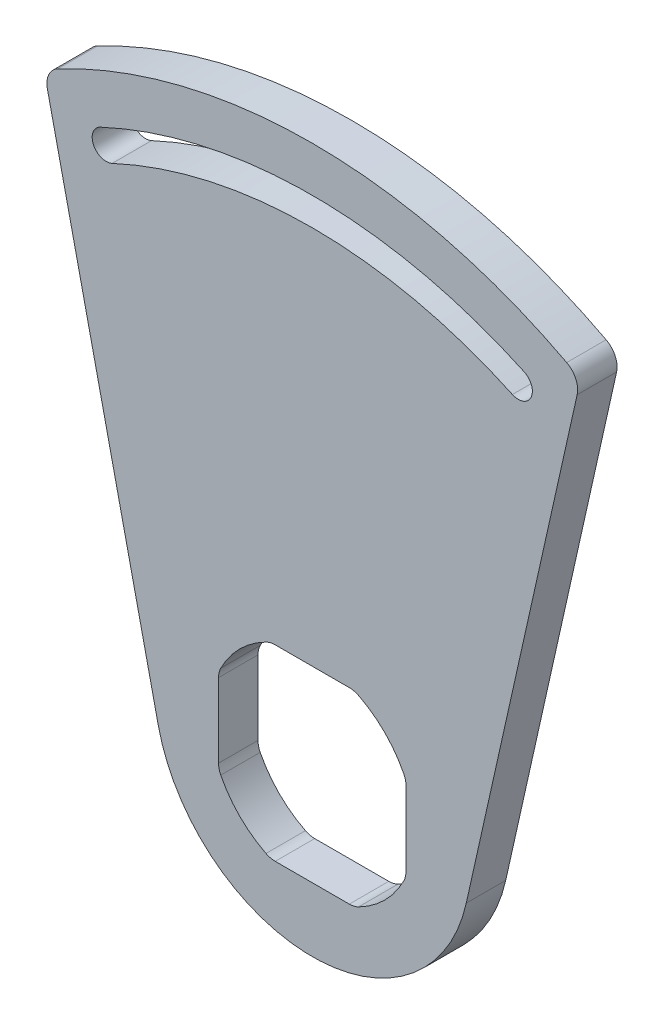
ISO-10303-21;
HEADER;
FILE_DESCRIPTION(('STEP AP214'),'2;1');
FILE_NAME('part.step','',(''),(''),'','','');
FILE_SCHEMA(('AUTOMOTIVE_DESIGN { 1 0 10303 214 1 1 1 1 }'));
ENDSEC;
DATA;
#1=APPLICATION_CONTEXT('core data for automotive mechanical design processes');
#2=APPLICATION_PROTOCOL_DEFINITION('international standard','automotive_design',2000,#1);
#3=PRODUCT_CONTEXT('',#1,'mechanical');
#4=PRODUCT('Part','Part','',(#3));
#5=PRODUCT_RELATED_PRODUCT_CATEGORY('part','',(#4));
#6=PRODUCT_DEFINITION_FORMATION('','',#4);
#7=PRODUCT_DEFINITION_CONTEXT('part definition',#1,'design');
#8=PRODUCT_DEFINITION('design','',#6,#7);
#9=PRODUCT_DEFINITION_SHAPE('','',#8);
#10=(LENGTH_UNIT() NAMED_UNIT(*) SI_UNIT(.MILLI.,.METRE.));
#11=(NAMED_UNIT(*) PLANE_ANGLE_UNIT() SI_UNIT($,.RADIAN.));
#12=(NAMED_UNIT(*) SI_UNIT($,.STERADIAN.) SOLID_ANGLE_UNIT());
#13=UNCERTAINTY_MEASURE_WITH_UNIT(LENGTH_MEASURE(1.E-05),#10,'distance_accuracy_value','');
#14=(GEOMETRIC_REPRESENTATION_CONTEXT(3) GLOBAL_UNCERTAINTY_ASSIGNED_CONTEXT((#13)) GLOBAL_UNIT_ASSIGNED_CONTEXT((#10,
#11,#12)) REPRESENTATION_CONTEXT('',''));
#15=CARTESIAN_POINT('',(0.,0.,0.));
#16=DIRECTION('',(0.,0.,1.));
#17=DIRECTION('',(1.,0.,0.));
#18=AXIS2_PLACEMENT_3D('',#15,#16,#17);
#19=CARTESIAN_POINT('',(0.,0.,6.35));
#20=DIRECTION('',(0.,0.,-1.));
#21=DIRECTION('',(-1.,0.,0.));
#22=AXIS2_PLACEMENT_3D('',#19,#20,#21);
#23=CYLINDRICAL_SURFACE('',#22,88.011);
#24=CARTESIAN_POINT('',(0.,0.,6.35));
#25=DIRECTION('',(0.,0.,1.));
#26=DIRECTION('',(1.,0.,0.));
#27=AXIS2_PLACEMENT_3D('',#24,#25,#26);
#28=CIRCLE('',#27,88.011);
#29=CARTESIAN_POINT('',(-40.9525219897179,77.9026768710914,6.35));
#30=VERTEX_POINT('',#29);
#31=CARTESIAN_POINT('',(40.9525219897176,77.9026768710915,6.35));
#32=VERTEX_POINT('',#31);
#33=EDGE_CURVE('E244',#30,#32,#28,.F.);
#34=ORIENTED_EDGE('',*,*,#33,.T.);
#35=DIRECTION('',(0.,0.,-1.));
#36=VECTOR('',#35,1.);
#37=CARTESIAN_POINT('',(40.9525219897176,77.9026768710915,6.35));
#38=LINE('',#37,#36);
#39=CARTESIAN_POINT('',(40.9525219897176,77.9026768710915,0.));
#40=VERTEX_POINT('',#39);
#41=EDGE_CURVE('E382',#32,#40,#38,.T.);
#42=ORIENTED_EDGE('',*,*,#41,.T.);
#43=CARTESIAN_POINT('',(0.,0.,0.));
#44=DIRECTION('',(0.,0.,1.));
#45=DIRECTION('',(1.,0.,0.));
#46=AXIS2_PLACEMENT_3D('',#43,#44,#45);
#47=CIRCLE('',#46,88.011);
#48=CARTESIAN_POINT('',(-40.9525219897179,77.9026768710914,0.));
#49=VERTEX_POINT('',#48);
#50=EDGE_CURVE('E288',#49,#40,#47,.F.);
#51=ORIENTED_EDGE('',*,*,#50,.F.);
#52=DIRECTION('',(0.,0.,-1.));
#53=VECTOR('',#52,1.);
#54=CARTESIAN_POINT('',(-40.9525219897179,77.9026768710914,6.35));
#55=LINE('',#54,#53);
#56=EDGE_CURVE('E380',#49,#30,#55,.F.);
#57=ORIENTED_EDGE('',*,*,#56,.T.);
#58=EDGE_LOOP('',(#34,#42,#51,#57));
#59=FACE_BOUND('',#58,.T.);
#60=ADVANCED_FACE('F37',(#59),#23,.T.);
#61=CARTESIAN_POINT('',(-24.7874429520375,-5.5446074612623,6.35));
#62=DIRECTION('',(-0.975883580788879,-0.218291632333161,0.));
#63=DIRECTION('',(0.218291632333161,-0.975883580788879,0.));
#64=AXIS2_PLACEMENT_3D('',#61,#62,#63);
#65=PLANE('',#64);
#66=DIRECTION('',(-0.218291632333161,0.975883580788879,0.));
#67=VECTOR('',#66,1.);
#68=CARTESIAN_POINT('',(-24.7874429520375,-5.5446074612623,6.35));
#69=LINE('',#68,#67);
#70=CARTESIAN_POINT('',(-24.7874429520375,-5.5446074612623,6.35));
#71=VERTEX_POINT('',#70);
#72=CARTESIAN_POINT('',(-42.6384313170143,74.2591223475221,6.35));
#73=VERTEX_POINT('',#72);
#74=EDGE_CURVE('E247',#71,#73,#69,.T.);
#75=ORIENTED_EDGE('',*,*,#74,.T.);
#76=DIRECTION('',(0.,0.,-1.));
#77=VECTOR('',#76,1.);
#78=CARTESIAN_POINT('',(-42.6384313170143,74.2591223475221,6.35));
#79=LINE('',#78,#77);
#80=CARTESIAN_POINT('',(-42.6384313170143,74.2591223475221,0.));
#81=VERTEX_POINT('',#80);
#82=EDGE_CURVE('E11',#73,#81,#79,.T.);
#83=ORIENTED_EDGE('',*,*,#82,.T.);
#84=DIRECTION('',(-0.218291632333161,0.975883580788879,0.));
#85=VECTOR('',#84,1.);
#86=CARTESIAN_POINT('',(-24.7874429520375,-5.5446074612623,0.));
#87=LINE('',#86,#85);
#88=CARTESIAN_POINT('',(-24.7874429520375,-5.5446074612623,0.));
#89=VERTEX_POINT('',#88);
#90=EDGE_CURVE('E291',#89,#81,#87,.T.);
#91=ORIENTED_EDGE('',*,*,#90,.F.);
#92=DIRECTION('',(0.,0.,-1.));
#93=VECTOR('',#92,1.);
#94=CARTESIAN_POINT('',(-24.7874429520375,-5.5446074612623,6.35));
#95=LINE('',#94,#93);
#96=EDGE_CURVE('E302',#71,#89,#95,.T.);
#97=ORIENTED_EDGE('',*,*,#96,.F.);
#98=EDGE_LOOP('',(#75,#83,#91,#97));
#99=FACE_BOUND('',#98,.T.);
#100=ADVANCED_FACE('F407',(#99),#65,.T.);
#101=CARTESIAN_POINT('',(0.,0.,6.35));
#102=DIRECTION('',(0.,0.,-1.));
#103=DIRECTION('',(-1.,0.,0.));
#104=AXIS2_PLACEMENT_3D('',#101,#102,#103);
#105=CYLINDRICAL_SURFACE('',#104,25.4);
#106=CARTESIAN_POINT('',(0.,0.,0.));
#107=DIRECTION('',(0.,0.,1.));
#108=DIRECTION('',(1.,0.,0.));
#109=AXIS2_PLACEMENT_3D('',#106,#107,#108);
#110=CIRCLE('',#109,25.4);
#111=CARTESIAN_POINT('',(24.7874429520375,-5.5446074612622,0.));
#112=VERTEX_POINT('',#111);
#113=EDGE_CURVE('E294',#89,#112,#110,.T.);
#114=ORIENTED_EDGE('',*,*,#113,.T.);
#115=DIRECTION('',(0.,0.,-1.));
#116=VECTOR('',#115,1.);
#117=CARTESIAN_POINT('',(24.7874429520375,-5.5446074612622,6.35));
#118=LINE('',#117,#116);
#119=CARTESIAN_POINT('',(24.7874429520375,-5.5446074612622,6.35));
#120=VERTEX_POINT('',#119);
#121=EDGE_CURVE('E223',#120,#112,#118,.T.);
#122=ORIENTED_EDGE('',*,*,#121,.F.);
#123=CARTESIAN_POINT('',(0.,0.,6.35));
#124=DIRECTION('',(0.,0.,1.));
#125=DIRECTION('',(1.,0.,0.));
#126=AXIS2_PLACEMENT_3D('',#123,#124,#125);
#127=CIRCLE('',#126,25.4);
#128=EDGE_CURVE('E249',#71,#120,#127,.T.);
#129=ORIENTED_EDGE('',*,*,#128,.F.);
#130=ORIENTED_EDGE('',*,*,#96,.T.);
#131=EDGE_LOOP('',(#114,#122,#129,#130));
#132=FACE_BOUND('',#131,.T.);
#133=ADVANCED_FACE('F404',(#132),#105,.T.);
#134=CARTESIAN_POINT('',(-33.1696168909806,71.1324729733585,6.35));
#135=DIRECTION('',(0.,0.,-1.));
#136=DIRECTION('',(-1.,0.,0.));
#137=AXIS2_PLACEMENT_3D('',#134,#135,#136);
#138=CYLINDRICAL_SURFACE('',#137,2.2606000000003);
#139=CARTESIAN_POINT('',(-33.1696168909806,71.1324729733585,0.));
#140=DIRECTION('',(0.,0.,1.));
#141=DIRECTION('',(1.,0.,0.));
#142=AXIS2_PLACEMENT_3D('',#139,#140,#141);
#143=CIRCLE('',#142,2.2606000000003);
#144=CARTESIAN_POINT('',(-34.1249888205343,73.1812718498279,0.));
#145=VERTEX_POINT('',#144);
#146=CARTESIAN_POINT('',(-32.2142470766446,69.0836731105469,0.));
#147=VERTEX_POINT('',#146);
#148=EDGE_CURVE('E218',#145,#147,#143,.T.);
#149=ORIENTED_EDGE('',*,*,#148,.F.);
#150=DIRECTION('',(0.,0.,-1.));
#151=VECTOR('',#150,1.);
#152=CARTESIAN_POINT('',(-34.1249888205343,73.1812718498279,6.35));
#153=LINE('',#152,#151);
#154=CARTESIAN_POINT('',(-34.1249888205343,73.1812718498279,6.35));
#155=VERTEX_POINT('',#154);
#156=EDGE_CURVE('E213',#155,#145,#153,.T.);
#157=ORIENTED_EDGE('',*,*,#156,.F.);
#158=CARTESIAN_POINT('',(-33.1696168909806,71.1324729733585,6.35));
#159=DIRECTION('',(0.,0.,1.));
#160=DIRECTION('',(1.,0.,0.));
#161=AXIS2_PLACEMENT_3D('',#158,#159,#160);
#162=CIRCLE('',#161,2.2606000000003);
#163=CARTESIAN_POINT('',(-32.2142470766446,69.0836731105469,6.35));
#164=VERTEX_POINT('',#163);
#165=EDGE_CURVE('E216',#155,#164,#162,.T.);
#166=ORIENTED_EDGE('',*,*,#165,.T.);
#167=DIRECTION('',(0.,0.,-1.));
#168=VECTOR('',#167,1.);
#169=CARTESIAN_POINT('',(-32.2142470766446,69.0836731105469,6.35));
#170=LINE('',#169,#168);
#171=EDGE_CURVE('E254',#164,#147,#170,.T.);
#172=ORIENTED_EDGE('',*,*,#171,.T.);
#173=EDGE_LOOP('',(#149,#157,#166,#172));
#174=FACE_BOUND('',#173,.T.);
#175=ADVANCED_FACE('F215',(#174),#138,.F.);
#176=CARTESIAN_POINT('',(0.,0.,6.35));
#177=DIRECTION('',(0.,0.,-1.));
#178=DIRECTION('',(-1.,0.,0.));
#179=AXIS2_PLACEMENT_3D('',#176,#177,#178);
#180=CYLINDRICAL_SURFACE('',#179,80.7466);
#181=CARTESIAN_POINT('',(0.,0.,0.));
#182=DIRECTION('',(0.,0.,1.));
#183=DIRECTION('',(1.,0.,0.));
#184=AXIS2_PLACEMENT_3D('',#181,#182,#183);
#185=CIRCLE('',#184,80.7466);
#186=CARTESIAN_POINT('',(34.1249888205343,73.1812718498279,0.));
#187=VERTEX_POINT('',#186);
#188=EDGE_CURVE('E280',#187,#145,#185,.T.);
#189=ORIENTED_EDGE('',*,*,#188,.F.);
#190=DIRECTION('',(0.,0.,-1.));
#191=VECTOR('',#190,1.);
#192=CARTESIAN_POINT('',(34.1249888205343,73.1812718498279,6.35));
#193=LINE('',#192,#191);
#194=CARTESIAN_POINT('',(34.1249888205343,73.1812718498279,6.35));
#195=VERTEX_POINT('',#194);
#196=EDGE_CURVE('E224',#195,#187,#193,.T.);
#197=ORIENTED_EDGE('',*,*,#196,.F.);
#198=CARTESIAN_POINT('',(0.,0.,6.35));
#199=DIRECTION('',(0.,0.,1.));
#200=DIRECTION('',(1.,0.,0.));
#201=AXIS2_PLACEMENT_3D('',#198,#199,#200);
#202=CIRCLE('',#201,80.7466);
#203=EDGE_CURVE('E230',#195,#155,#202,.T.);
#204=ORIENTED_EDGE('',*,*,#203,.T.);
#205=ORIENTED_EDGE('',*,*,#156,.T.);
#206=EDGE_LOOP('',(#189,#197,#204,#205));
#207=FACE_BOUND('',#206,.T.);
#208=ADVANCED_FACE('F237',(#207),#180,.F.);
#209=CARTESIAN_POINT('',(33.1696168909806,71.1324729733585,6.35));
#210=DIRECTION('',(0.,0.,-1.));
#211=DIRECTION('',(-1.,0.,0.));
#212=AXIS2_PLACEMENT_3D('',#209,#210,#211);
#213=CYLINDRICAL_SURFACE('',#212,2.26060000000027);
#214=CARTESIAN_POINT('',(33.1696168909806,71.1324729733585,0.));
#215=DIRECTION('',(0.,0.,1.));
#216=DIRECTION('',(1.,0.,0.));
#217=AXIS2_PLACEMENT_3D('',#214,#215,#216);
#218=CIRCLE('',#217,2.26060000000027);
#219=CARTESIAN_POINT('',(32.2142470766445,69.0836731105469,0.));
#220=VERTEX_POINT('',#219);
#221=EDGE_CURVE('E282',#220,#187,#218,.T.);
#222=ORIENTED_EDGE('',*,*,#221,.F.);
#223=DIRECTION('',(0.,0.,-1.));
#224=VECTOR('',#223,1.);
#225=CARTESIAN_POINT('',(32.2142470766445,69.0836731105469,6.35));
#226=LINE('',#225,#224);
#227=CARTESIAN_POINT('',(32.2142470766445,69.0836731105469,6.35));
#228=VERTEX_POINT('',#227);
#229=EDGE_CURVE('E306',#228,#220,#226,.T.);
#230=ORIENTED_EDGE('',*,*,#229,.F.);
#231=CARTESIAN_POINT('',(33.1696168909806,71.1324729733585,6.35));
#232=DIRECTION('',(0.,0.,1.));
#233=DIRECTION('',(1.,0.,0.));
#234=AXIS2_PLACEMENT_3D('',#231,#232,#233);
#235=CIRCLE('',#234,2.26060000000027);
#236=EDGE_CURVE('E238',#228,#195,#235,.T.);
#237=ORIENTED_EDGE('',*,*,#236,.T.);
#238=ORIENTED_EDGE('',*,*,#196,.T.);
#239=EDGE_LOOP('',(#222,#230,#237,#238));
#240=FACE_BOUND('',#239,.T.);
#241=ADVANCED_FACE('F430',(#240),#213,.F.);
#242=CARTESIAN_POINT('',(0.,0.,6.35));
#243=DIRECTION('',(0.,0.,-1.));
#244=DIRECTION('',(-1.,0.,0.));
#245=AXIS2_PLACEMENT_3D('',#242,#243,#244);
#246=CYLINDRICAL_SURFACE('',#245,16.51);
#247=CARTESIAN_POINT('',(0.,0.,0.));
#248=DIRECTION('',(0.,0.,1.));
#249=DIRECTION('',(1.,0.,0.));
#250=AXIS2_PLACEMENT_3D('',#247,#248,#249);
#251=CIRCLE('',#250,16.51);
#252=CARTESIAN_POINT('',(-7.45307158156958,14.732,0.));
#253=VERTEX_POINT('',#252);
#254=CARTESIAN_POINT('',(-14.732,7.45307158156957,0.));
#255=VERTEX_POINT('',#254);
#256=EDGE_CURVE('E255',#253,#255,#251,.T.);
#257=ORIENTED_EDGE('',*,*,#256,.F.);
#258=DIRECTION('',(0.,0.,-1.));
#259=VECTOR('',#258,1.);
#260=CARTESIAN_POINT('',(-7.45307158156958,14.732,6.35));
#261=LINE('',#260,#259);
#262=CARTESIAN_POINT('',(-7.45307158156958,14.732,6.35));
#263=VERTEX_POINT('',#262);
#264=EDGE_CURVE('E316',#253,#263,#261,.F.);
#265=ORIENTED_EDGE('',*,*,#264,.T.);
#266=CARTESIAN_POINT('',(0.,0.,6.35));
#267=DIRECTION('',(0.,0.,1.));
#268=DIRECTION('',(1.,0.,0.));
#269=AXIS2_PLACEMENT_3D('',#266,#267,#268);
#270=CIRCLE('',#269,16.51);
#271=CARTESIAN_POINT('',(-14.732,7.45307158156957,6.35));
#272=VERTEX_POINT('',#271);
#273=EDGE_CURVE('E299',#263,#272,#270,.T.);
#274=ORIENTED_EDGE('',*,*,#273,.T.);
#275=DIRECTION('',(0.,0.,-1.));
#276=VECTOR('',#275,1.);
#277=CARTESIAN_POINT('',(-14.732,7.45307158156957,6.35));
#278=LINE('',#277,#276);
#279=EDGE_CURVE('E313',#272,#255,#278,.T.);
#280=ORIENTED_EDGE('',*,*,#279,.T.);
#281=EDGE_LOOP('',(#257,#265,#274,#280));
#282=FACE_BOUND('',#281,.T.);
#283=ADVANCED_FACE('F433',(#282),#246,.F.);
#284=CARTESIAN_POINT('',(0.,15.0876,6.35));
#285=DIRECTION('',(0.,-1.,0.));
#286=DIRECTION('',(1.,0.,0.));
#287=AXIS2_PLACEMENT_3D('',#284,#285,#286);
#288=PLANE('',#287);
#289=DIRECTION('',(-1.,0.,0.));
#290=VECTOR('',#289,1.);
#291=CARTESIAN_POINT('',(0.,15.0876,6.35));
#292=LINE('',#291,#290);
#293=CARTESIAN_POINT('',(5.96245726525566,15.0876,6.35));
#294=VERTEX_POINT('',#293);
#295=CARTESIAN_POINT('',(-5.96245726525566,15.0876,6.35));
#296=VERTEX_POINT('',#295);
#297=EDGE_CURVE('E510',#294,#296,#292,.T.);
#298=ORIENTED_EDGE('',*,*,#297,.T.);
#299=DIRECTION('',(0.,0.,1.));
#300=VECTOR('',#299,1.);
#301=CARTESIAN_POINT('',(-5.96245726525566,15.0876,0.));
#302=LINE('',#301,#300);
#303=CARTESIAN_POINT('',(-5.96245726525566,15.0876,0.));
#304=VERTEX_POINT('',#303);
#305=EDGE_CURVE('E310',#296,#304,#302,.F.);
#306=ORIENTED_EDGE('',*,*,#305,.T.);
#307=DIRECTION('',(-1.,0.,0.));
#308=VECTOR('',#307,1.);
#309=CARTESIAN_POINT('',(0.,15.0876,0.));
#310=LINE('',#309,#308);
#311=CARTESIAN_POINT('',(5.96245726525566,15.0876,0.));
#312=VERTEX_POINT('',#311);
#313=EDGE_CURVE('E258',#312,#304,#310,.T.);
#314=ORIENTED_EDGE('',*,*,#313,.F.);
#315=DIRECTION('',(0.,0.,1.));
#316=VECTOR('',#315,1.);
#317=CARTESIAN_POINT('',(5.96245726525566,15.0876,6.35));
#318=LINE('',#317,#316);
#319=EDGE_CURVE('E304',#312,#294,#318,.T.);
#320=ORIENTED_EDGE('',*,*,#319,.T.);
#321=EDGE_LOOP('',(#298,#306,#314,#320));
#322=FACE_BOUND('',#321,.T.);
#323=ADVANCED_FACE('F460',(#322),#288,.T.);
#324=CARTESIAN_POINT('',(0.,0.,6.35));
#325=DIRECTION('',(0.,0.,-1.));
#326=DIRECTION('',(-1.,0.,0.));
#327=AXIS2_PLACEMENT_3D('',#324,#325,#326);
#328=CYLINDRICAL_SURFACE('',#327,16.51);
#329=CARTESIAN_POINT('',(0.,0.,6.35));
#330=DIRECTION('',(0.,0.,1.));
#331=DIRECTION('',(1.,0.,0.));
#332=AXIS2_PLACEMENT_3D('',#329,#330,#331);
#333=CIRCLE('',#332,16.51);
#334=CARTESIAN_POINT('',(14.732,7.45307158156958,6.35));
#335=VERTEX_POINT('',#334);
#336=CARTESIAN_POINT('',(7.45307158156958,14.732,6.35));
#337=VERTEX_POINT('',#336);
#338=EDGE_CURVE('E513',#335,#337,#333,.T.);
#339=ORIENTED_EDGE('',*,*,#338,.T.);
#340=DIRECTION('',(0.,0.,-1.));
#341=VECTOR('',#340,1.);
#342=CARTESIAN_POINT('',(7.45307158156958,14.732,6.35));
#343=LINE('',#342,#341);
#344=CARTESIAN_POINT('',(7.45307158156958,14.732,0.));
#345=VERTEX_POINT('',#344);
#346=EDGE_CURVE('E320',#337,#345,#343,.T.);
#347=ORIENTED_EDGE('',*,*,#346,.T.);
#348=CARTESIAN_POINT('',(0.,0.,0.));
#349=DIRECTION('',(0.,0.,1.));
#350=DIRECTION('',(1.,0.,0.));
#351=AXIS2_PLACEMENT_3D('',#348,#349,#350);
#352=CIRCLE('',#351,16.51);
#353=CARTESIAN_POINT('',(14.732,7.45307158156958,0.));
#354=VERTEX_POINT('',#353);
#355=EDGE_CURVE('E261',#354,#345,#352,.T.);
#356=ORIENTED_EDGE('',*,*,#355,.F.);
#357=DIRECTION('',(0.,0.,-1.));
#358=VECTOR('',#357,1.);
#359=CARTESIAN_POINT('',(14.732,7.45307158156958,6.35));
#360=LINE('',#359,#358);
#361=EDGE_CURVE('E318',#354,#335,#360,.F.);
#362=ORIENTED_EDGE('',*,*,#361,.T.);
#363=EDGE_LOOP('',(#339,#347,#356,#362));
#364=FACE_BOUND('',#363,.T.);
#365=ADVANCED_FACE('F456',(#364),#328,.F.);
#366=CARTESIAN_POINT('',(15.0876,0.,6.35));
#367=DIRECTION('',(-1.,0.,0.));
#368=DIRECTION('',(0.,0.,1.));
#369=AXIS2_PLACEMENT_3D('',#366,#367,#368);
#370=PLANE('',#369);
#371=DIRECTION('',(0.,1.,0.));
#372=VECTOR('',#371,1.);
#373=CARTESIAN_POINT('',(15.0876,0.,0.));
#374=LINE('',#373,#372);
#375=CARTESIAN_POINT('',(15.0876,-5.96245726525566,0.));
#376=VERTEX_POINT('',#375);
#377=CARTESIAN_POINT('',(15.0876,5.96245726525566,0.));
#378=VERTEX_POINT('',#377);
#379=EDGE_CURVE('E264',#376,#378,#374,.T.);
#380=ORIENTED_EDGE('',*,*,#379,.F.);
#381=DIRECTION('',(0.,0.,1.));
#382=VECTOR('',#381,1.);
#383=CARTESIAN_POINT('',(15.0876,-5.96245726525566,6.35));
#384=LINE('',#383,#382);
#385=CARTESIAN_POINT('',(15.0876,-5.96245726525566,6.35));
#386=VERTEX_POINT('',#385);
#387=EDGE_CURVE('E331',#376,#386,#384,.T.);
#388=ORIENTED_EDGE('',*,*,#387,.T.);
#389=DIRECTION('',(0.,1.,0.));
#390=VECTOR('',#389,1.);
#391=CARTESIAN_POINT('',(15.0876,0.,6.35));
#392=LINE('',#391,#390);
#393=CARTESIAN_POINT('',(15.0876,5.96245726525566,6.35));
#394=VERTEX_POINT('',#393);
#395=EDGE_CURVE('E518',#386,#394,#392,.T.);
#396=ORIENTED_EDGE('',*,*,#395,.T.);
#397=DIRECTION('',(0.,0.,1.));
#398=VECTOR('',#397,1.);
#399=CARTESIAN_POINT('',(15.0876,5.96245726525566,0.));
#400=LINE('',#399,#398);
#401=EDGE_CURVE('E328',#394,#378,#400,.F.);
#402=ORIENTED_EDGE('',*,*,#401,.T.);
#403=EDGE_LOOP('',(#380,#388,#396,#402));
#404=FACE_BOUND('',#403,.T.);
#405=ADVANCED_FACE('F452',(#404),#370,.T.);
#406=CARTESIAN_POINT('',(0.,0.,6.35));
#407=DIRECTION('',(0.,0.,-1.));
#408=DIRECTION('',(-1.,0.,0.));
#409=AXIS2_PLACEMENT_3D('',#406,#407,#408);
#410=CYLINDRICAL_SURFACE('',#409,16.51);
#411=CARTESIAN_POINT('',(0.,0.,6.35));
#412=DIRECTION('',(0.,0.,1.));
#413=DIRECTION('',(1.,0.,0.));
#414=AXIS2_PLACEMENT_3D('',#411,#412,#413);
#415=CIRCLE('',#414,16.51);
#416=CARTESIAN_POINT('',(7.45307158156958,-14.732,6.35));
#417=VERTEX_POINT('',#416);
#418=CARTESIAN_POINT('',(14.732,-7.45307158156958,6.35));
#419=VERTEX_POINT('',#418);
#420=EDGE_CURVE('E521',#417,#419,#415,.T.);
#421=ORIENTED_EDGE('',*,*,#420,.T.);
#422=DIRECTION('',(0.,0.,-1.));
#423=VECTOR('',#422,1.);
#424=CARTESIAN_POINT('',(14.732,-7.45307158156958,6.35));
#425=LINE('',#424,#423);
#426=CARTESIAN_POINT('',(14.732,-7.45307158156958,0.));
#427=VERTEX_POINT('',#426);
#428=EDGE_CURVE('E325',#419,#427,#425,.T.);
#429=ORIENTED_EDGE('',*,*,#428,.T.);
#430=CARTESIAN_POINT('',(0.,0.,0.));
#431=DIRECTION('',(0.,0.,1.));
#432=DIRECTION('',(1.,0.,0.));
#433=AXIS2_PLACEMENT_3D('',#430,#431,#432);
#434=CIRCLE('',#433,16.51);
#435=CARTESIAN_POINT('',(7.45307158156958,-14.732,0.));
#436=VERTEX_POINT('',#435);
#437=EDGE_CURVE('E267',#436,#427,#434,.T.);
#438=ORIENTED_EDGE('',*,*,#437,.F.);
#439=DIRECTION('',(0.,0.,-1.));
#440=VECTOR('',#439,1.);
#441=CARTESIAN_POINT('',(7.45307158156958,-14.732,6.35));
#442=LINE('',#441,#440);
#443=EDGE_CURVE('E323',#436,#417,#442,.F.);
#444=ORIENTED_EDGE('',*,*,#443,.T.);
#445=EDGE_LOOP('',(#421,#429,#438,#444));
#446=FACE_BOUND('',#445,.T.);
#447=ADVANCED_FACE('F448',(#446),#410,.F.);
#448=CARTESIAN_POINT('',(0.,-15.0876,6.35));
#449=DIRECTION('',(0.,-1.,0.));
#450=DIRECTION('',(1.,0.,0.));
#451=AXIS2_PLACEMENT_3D('',#448,#449,#450);
#452=PLANE('',#451);
#453=DIRECTION('',(-1.,0.,0.));
#454=VECTOR('',#453,1.);
#455=CARTESIAN_POINT('',(0.,-15.0876,0.));
#456=LINE('',#455,#454);
#457=CARTESIAN_POINT('',(5.96245726525566,-15.0876,0.));
#458=VERTEX_POINT('',#457);
#459=CARTESIAN_POINT('',(-5.96245726525566,-15.0876,0.));
#460=VERTEX_POINT('',#459);
#461=EDGE_CURVE('E270',#458,#460,#456,.T.);
#462=ORIENTED_EDGE('',*,*,#461,.T.);
#463=DIRECTION('',(0.,0.,-1.));
#464=VECTOR('',#463,1.);
#465=CARTESIAN_POINT('',(-5.96245726525566,-15.0876,6.35));
#466=LINE('',#465,#464);
#467=CARTESIAN_POINT('',(-5.96245726525566,-15.0876,6.35));
#468=VERTEX_POINT('',#467);
#469=EDGE_CURVE('E341',#460,#468,#466,.F.);
#470=ORIENTED_EDGE('',*,*,#469,.T.);
#471=DIRECTION('',(-1.,0.,0.));
#472=VECTOR('',#471,1.);
#473=CARTESIAN_POINT('',(0.,-15.0876,6.35));
#474=LINE('',#473,#472);
#475=CARTESIAN_POINT('',(5.96245726525566,-15.0876,6.35));
#476=VERTEX_POINT('',#475);
#477=EDGE_CURVE('E524',#476,#468,#474,.T.);
#478=ORIENTED_EDGE('',*,*,#477,.F.);
#479=DIRECTION('',(0.,0.,-1.));
#480=VECTOR('',#479,1.);
#481=CARTESIAN_POINT('',(5.96245726525566,-15.0876,6.35));
#482=LINE('',#481,#480);
#483=EDGE_CURVE('E338',#476,#458,#482,.T.);
#484=ORIENTED_EDGE('',*,*,#483,.T.);
#485=EDGE_LOOP('',(#462,#470,#478,#484));
#486=FACE_BOUND('',#485,.T.);
#487=ADVANCED_FACE('F444',(#486),#452,.F.);
#488=CARTESIAN_POINT('',(0.,0.,6.35));
#489=DIRECTION('',(0.,0.,-1.));
#490=DIRECTION('',(-1.,0.,0.));
#491=AXIS2_PLACEMENT_3D('',#488,#489,#490);
#492=CYLINDRICAL_SURFACE('',#491,16.51);
#493=CARTESIAN_POINT('',(0.,0.,6.35));
#494=DIRECTION('',(0.,0.,1.));
#495=DIRECTION('',(1.,0.,0.));
#496=AXIS2_PLACEMENT_3D('',#493,#494,#495);
#497=CIRCLE('',#496,16.51);
#498=CARTESIAN_POINT('',(-14.732,-7.45307158156957,6.35));
#499=VERTEX_POINT('',#498);
#500=CARTESIAN_POINT('',(-7.45307158156958,-14.732,6.35));
#501=VERTEX_POINT('',#500);
#502=EDGE_CURVE('E527',#499,#501,#497,.T.);
#503=ORIENTED_EDGE('',*,*,#502,.T.);
#504=DIRECTION('',(0.,0.,-1.));
#505=VECTOR('',#504,1.);
#506=CARTESIAN_POINT('',(-7.45307158156958,-14.732,6.35));
#507=LINE('',#506,#505);
#508=CARTESIAN_POINT('',(-7.45307158156958,-14.732,0.));
#509=VERTEX_POINT('',#508);
#510=EDGE_CURVE('E335',#501,#509,#507,.T.);
#511=ORIENTED_EDGE('',*,*,#510,.T.);
#512=CARTESIAN_POINT('',(0.,0.,0.));
#513=DIRECTION('',(0.,0.,1.));
#514=DIRECTION('',(1.,0.,0.));
#515=AXIS2_PLACEMENT_3D('',#512,#513,#514);
#516=CIRCLE('',#515,16.51);
#517=CARTESIAN_POINT('',(-14.732,-7.45307158156957,0.));
#518=VERTEX_POINT('',#517);
#519=EDGE_CURVE('E273',#518,#509,#516,.T.);
#520=ORIENTED_EDGE('',*,*,#519,.F.);
#521=DIRECTION('',(0.,0.,-1.));
#522=VECTOR('',#521,1.);
#523=CARTESIAN_POINT('',(-14.732,-7.45307158156957,6.35));
#524=LINE('',#523,#522);
#525=EDGE_CURVE('E333',#518,#499,#524,.F.);
#526=ORIENTED_EDGE('',*,*,#525,.T.);
#527=EDGE_LOOP('',(#503,#511,#520,#526));
#528=FACE_BOUND('',#527,.T.);
#529=ADVANCED_FACE('F428',(#528),#492,.F.);
#530=CARTESIAN_POINT('',(0.,0.,6.35));
#531=DIRECTION('',(0.,0.,-1.));
#532=DIRECTION('',(-1.,0.,0.));
#533=AXIS2_PLACEMENT_3D('',#530,#531,#532);
#534=CYLINDRICAL_SURFACE('',#533,76.2254000000001);
#535=CARTESIAN_POINT('',(0.,0.,0.));
#536=DIRECTION('',(0.,0.,1.));
#537=DIRECTION('',(1.,0.,0.));
#538=AXIS2_PLACEMENT_3D('',#535,#536,#537);
#539=CIRCLE('',#538,76.2254000000001);
#540=EDGE_CURVE('E285',#220,#147,#539,.T.);
#541=ORIENTED_EDGE('',*,*,#540,.T.);
#542=ORIENTED_EDGE('',*,*,#171,.F.);
#543=CARTESIAN_POINT('',(0.,0.,6.35));
#544=DIRECTION('',(0.,0.,1.));
#545=DIRECTION('',(1.,0.,0.));
#546=AXIS2_PLACEMENT_3D('',#543,#544,#545);
#547=CIRCLE('',#546,76.2254000000001);
#548=EDGE_CURVE('E233',#228,#164,#547,.T.);
#549=ORIENTED_EDGE('',*,*,#548,.F.);
#550=ORIENTED_EDGE('',*,*,#229,.T.);
#551=EDGE_LOOP('',(#541,#542,#549,#550));
#552=FACE_BOUND('',#551,.T.);
#553=ADVANCED_FACE('F424',(#552),#534,.T.);
#554=CARTESIAN_POINT('',(-15.0876,0.,6.35));
#555=DIRECTION('',(-1.,0.,0.));
#556=DIRECTION('',(0.,0.,1.));
#557=AXIS2_PLACEMENT_3D('',#554,#555,#556);
#558=PLANE('',#557);
#559=DIRECTION('',(0.,1.,0.));
#560=VECTOR('',#559,1.);
#561=CARTESIAN_POINT('',(-15.0876,0.,6.35));
#562=LINE('',#561,#560);
#563=CARTESIAN_POINT('',(-15.0876,-5.96245726525566,6.35));
#564=VERTEX_POINT('',#563);
#565=CARTESIAN_POINT('',(-15.0876,5.96245726525566,6.35));
#566=VERTEX_POINT('',#565);
#567=EDGE_CURVE('E235',#564,#566,#562,.T.);
#568=ORIENTED_EDGE('',*,*,#567,.F.);
#569=DIRECTION('',(0.,0.,-1.));
#570=VECTOR('',#569,1.);
#571=CARTESIAN_POINT('',(-15.0876,-5.96245726525566,6.35));
#572=LINE('',#571,#570);
#573=CARTESIAN_POINT('',(-15.0876,-5.96245726525566,0.));
#574=VERTEX_POINT('',#573);
#575=EDGE_CURVE('E345',#564,#574,#572,.T.);
#576=ORIENTED_EDGE('',*,*,#575,.T.);
#577=DIRECTION('',(0.,1.,0.));
#578=VECTOR('',#577,1.);
#579=CARTESIAN_POINT('',(-15.0876,0.,0.));
#580=LINE('',#579,#578);
#581=CARTESIAN_POINT('',(-15.0876,5.96245726525566,0.));
#582=VERTEX_POINT('',#581);
#583=EDGE_CURVE('E276',#574,#582,#580,.T.);
#584=ORIENTED_EDGE('',*,*,#583,.T.);
#585=DIRECTION('',(0.,0.,-1.));
#586=VECTOR('',#585,1.);
#587=CARTESIAN_POINT('',(-15.0876,5.96245726525566,6.35));
#588=LINE('',#587,#586);
#589=EDGE_CURVE('E343',#582,#566,#588,.F.);
#590=ORIENTED_EDGE('',*,*,#589,.T.);
#591=EDGE_LOOP('',(#568,#576,#584,#590));
#592=FACE_BOUND('',#591,.T.);
#593=ADVANCED_FACE('F427',(#592),#558,.F.);
#594=CARTESIAN_POINT('',(24.7874429520375,-5.5446074612622,6.35));
#595=DIRECTION('',(-0.975883580788879,0.218291632333158,0.));
#596=DIRECTION('',(-0.218291632333158,-0.975883580788879,0.));
#597=AXIS2_PLACEMENT_3D('',#594,#595,#596);
#598=PLANE('',#597);
#599=DIRECTION('',(0.218291632333158,0.975883580788879,0.));
#600=VECTOR('',#599,1.);
#601=CARTESIAN_POINT('',(24.7874429520375,-5.5446074612622,0.));
#602=LINE('',#601,#600);
#603=CARTESIAN_POINT('',(42.638431317014,74.2591223475223,0.));
#604=VERTEX_POINT('',#603);
#605=EDGE_CURVE('E297',#112,#604,#602,.T.);
#606=ORIENTED_EDGE('',*,*,#605,.T.);
#607=DIRECTION('',(0.,0.,1.));
#608=VECTOR('',#607,1.);
#609=CARTESIAN_POINT('',(42.638431317014,74.2591223475223,6.35));
#610=LINE('',#609,#608);
#611=CARTESIAN_POINT('',(42.638431317014,74.2591223475223,6.35));
#612=VERTEX_POINT('',#611);
#613=EDGE_CURVE('E60',#604,#612,#610,.T.);
#614=ORIENTED_EDGE('',*,*,#613,.T.);
#615=DIRECTION('',(0.218291632333158,0.975883580788879,0.));
#616=VECTOR('',#615,1.);
#617=CARTESIAN_POINT('',(24.7874429520375,-5.5446074612622,6.35));
#618=LINE('',#617,#616);
#619=EDGE_CURVE('E252',#120,#612,#618,.T.);
#620=ORIENTED_EDGE('',*,*,#619,.F.);
#621=ORIENTED_EDGE('',*,*,#121,.T.);
#622=EDGE_LOOP('',(#606,#614,#620,#621));
#623=FACE_BOUND('',#622,.T.);
#624=ADVANCED_FACE('F400',(#623),#598,.F.);
#625=CARTESIAN_POINT('',(0.,0.,6.35));
#626=DIRECTION('',(0.,0.,1.));
#627=DIRECTION('',(1.,0.,0.));
#628=AXIS2_PLACEMENT_3D('',#625,#626,#627);
#629=PLANE('',#628);
#630=ORIENTED_EDGE('',*,*,#273,.F.);
#631=CARTESIAN_POINT('',(-5.96245726525566,11.7856,6.35));
#632=DIRECTION('',(0.,0.,1.));
#633=DIRECTION('',(1.,0.,0.));
#634=AXIS2_PLACEMENT_3D('',#631,#632,#633);
#635=CIRCLE('',#634,3.302);
#636=EDGE_CURVE('E350',#263,#296,#635,.F.);
#637=ORIENTED_EDGE('',*,*,#636,.T.);
#638=ORIENTED_EDGE('',*,*,#297,.F.);
#639=CARTESIAN_POINT('',(5.96245726525566,11.7856,6.35));
#640=DIRECTION('',(0.,0.,1.));
#641=DIRECTION('',(1.,0.,0.));
#642=AXIS2_PLACEMENT_3D('',#639,#640,#641);
#643=CIRCLE('',#642,3.302);
#644=EDGE_CURVE('E354',#294,#337,#643,.F.);
#645=ORIENTED_EDGE('',*,*,#644,.T.);
#646=ORIENTED_EDGE('',*,*,#338,.F.);
#647=CARTESIAN_POINT('',(11.7856,5.96245726525566,6.35));
#648=DIRECTION('',(0.,0.,1.));
#649=DIRECTION('',(1.,0.,0.));
#650=AXIS2_PLACEMENT_3D('',#647,#648,#649);
#651=CIRCLE('',#650,3.302);
#652=EDGE_CURVE('E362',#335,#394,#651,.F.);
#653=ORIENTED_EDGE('',*,*,#652,.T.);
#654=ORIENTED_EDGE('',*,*,#395,.F.);
#655=CARTESIAN_POINT('',(11.7856,-5.96245726525566,6.35));
#656=DIRECTION('',(0.,0.,1.));
#657=DIRECTION('',(1.,0.,0.));
#658=AXIS2_PLACEMENT_3D('',#655,#656,#657);
#659=CIRCLE('',#658,3.302);
#660=EDGE_CURVE('E358',#386,#419,#659,.F.);
#661=ORIENTED_EDGE('',*,*,#660,.T.);
#662=ORIENTED_EDGE('',*,*,#420,.F.);
#663=CARTESIAN_POINT('',(5.96245726525566,-11.7856,6.35));
#664=DIRECTION('',(0.,0.,1.));
#665=DIRECTION('',(1.,0.,0.));
#666=AXIS2_PLACEMENT_3D('',#663,#664,#665);
#667=CIRCLE('',#666,3.302);
#668=EDGE_CURVE('E370',#417,#476,#667,.F.);
#669=ORIENTED_EDGE('',*,*,#668,.T.);
#670=ORIENTED_EDGE('',*,*,#477,.T.);
#671=CARTESIAN_POINT('',(-5.96245726525566,-11.7856,6.35));
#672=DIRECTION('',(0.,0.,1.));
#673=DIRECTION('',(1.,0.,0.));
#674=AXIS2_PLACEMENT_3D('',#671,#672,#673);
#675=CIRCLE('',#674,3.302);
#676=EDGE_CURVE('E366',#468,#501,#675,.F.);
#677=ORIENTED_EDGE('',*,*,#676,.T.);
#678=ORIENTED_EDGE('',*,*,#502,.F.);
#679=CARTESIAN_POINT('',(-11.7856,-5.96245726525566,6.35));
#680=DIRECTION('',(0.,0.,1.));
#681=DIRECTION('',(1.,0.,0.));
#682=AXIS2_PLACEMENT_3D('',#679,#680,#681);
#683=CIRCLE('',#682,3.302);
#684=EDGE_CURVE('E374',#499,#564,#683,.F.);
#685=ORIENTED_EDGE('',*,*,#684,.T.);
#686=ORIENTED_EDGE('',*,*,#567,.T.);
#687=CARTESIAN_POINT('',(-11.7856,5.96245726525566,6.35));
#688=DIRECTION('',(0.,0.,1.));
#689=DIRECTION('',(1.,0.,0.));
#690=AXIS2_PLACEMENT_3D('',#687,#688,#689);
#691=CIRCLE('',#690,3.302);
#692=EDGE_CURVE('E378',#566,#272,#691,.F.);
#693=ORIENTED_EDGE('',*,*,#692,.T.);
#694=EDGE_LOOP('',(#630,#637,#638,#645,#646,#653,#654,#661,#662,#669,#670,#677,#678,#685,#686,#693));
#695=FACE_BOUND('',#694,.T.);
#696=ORIENTED_EDGE('',*,*,#165,.F.);
#697=ORIENTED_EDGE('',*,*,#203,.F.);
#698=ORIENTED_EDGE('',*,*,#236,.F.);
#699=ORIENTED_EDGE('',*,*,#548,.T.);
#700=EDGE_LOOP('',(#696,#697,#698,#699));
#701=FACE_BOUND('',#700,.T.);
#702=ORIENTED_EDGE('',*,*,#619,.T.);
#703=CARTESIAN_POINT('',(39.4160637332491,74.9799213174864,6.35));
#704=DIRECTION('',(0.,0.,1.));
#705=DIRECTION('',(1.,0.,0.));
#706=AXIS2_PLACEMENT_3D('',#703,#704,#705);
#707=CIRCLE('',#706,3.302);
#708=EDGE_CURVE('E45',#612,#32,#707,.T.);
#709=ORIENTED_EDGE('',*,*,#708,.T.);
#710=ORIENTED_EDGE('',*,*,#33,.F.);
#711=CARTESIAN_POINT('',(-39.4160637332494,74.9799213174862,6.35));
#712=DIRECTION('',(0.,0.,1.));
#713=DIRECTION('',(1.,0.,0.));
#714=AXIS2_PLACEMENT_3D('',#711,#712,#713);
#715=CIRCLE('',#714,3.302);
#716=EDGE_CURVE('E52',#30,#73,#715,.T.);
#717=ORIENTED_EDGE('',*,*,#716,.T.);
#718=ORIENTED_EDGE('',*,*,#74,.F.);
#719=ORIENTED_EDGE('',*,*,#128,.T.);
#720=EDGE_LOOP('',(#702,#709,#710,#717,#718,#719));
#721=FACE_BOUND('',#720,.T.);
#722=ADVANCED_FACE('F228',(#695,#701,#721),#629,.T.);
#723=CARTESIAN_POINT('',(0.,0.,0.));
#724=DIRECTION('',(0.,0.,1.));
#725=DIRECTION('',(1.,0.,0.));
#726=AXIS2_PLACEMENT_3D('',#723,#724,#725);
#727=PLANE('',#726);
#728=ORIENTED_EDGE('',*,*,#313,.T.);
#729=CARTESIAN_POINT('',(-5.96245726525566,11.7856,0.));
#730=DIRECTION('',(0.,0.,1.));
#731=DIRECTION('',(1.,0.,0.));
#732=AXIS2_PLACEMENT_3D('',#729,#730,#731);
#733=CIRCLE('',#732,3.302);
#734=EDGE_CURVE('E348',#304,#253,#733,.T.);
#735=ORIENTED_EDGE('',*,*,#734,.T.);
#736=ORIENTED_EDGE('',*,*,#256,.T.);
#737=CARTESIAN_POINT('',(-11.7856,5.96245726525566,0.));
#738=DIRECTION('',(0.,0.,1.));
#739=DIRECTION('',(1.,0.,0.));
#740=AXIS2_PLACEMENT_3D('',#737,#738,#739);
#741=CIRCLE('',#740,3.302);
#742=EDGE_CURVE('E376',#255,#582,#741,.T.);
#743=ORIENTED_EDGE('',*,*,#742,.T.);
#744=ORIENTED_EDGE('',*,*,#583,.F.);
#745=CARTESIAN_POINT('',(-11.7856,-5.96245726525566,0.));
#746=DIRECTION('',(0.,0.,1.));
#747=DIRECTION('',(1.,0.,0.));
#748=AXIS2_PLACEMENT_3D('',#745,#746,#747);
#749=CIRCLE('',#748,3.302);
#750=EDGE_CURVE('E372',#574,#518,#749,.T.);
#751=ORIENTED_EDGE('',*,*,#750,.T.);
#752=ORIENTED_EDGE('',*,*,#519,.T.);
#753=CARTESIAN_POINT('',(-5.96245726525566,-11.7856,0.));
#754=DIRECTION('',(0.,0.,1.));
#755=DIRECTION('',(1.,0.,0.));
#756=AXIS2_PLACEMENT_3D('',#753,#754,#755);
#757=CIRCLE('',#756,3.302);
#758=EDGE_CURVE('E364',#509,#460,#757,.T.);
#759=ORIENTED_EDGE('',*,*,#758,.T.);
#760=ORIENTED_EDGE('',*,*,#461,.F.);
#761=CARTESIAN_POINT('',(5.96245726525566,-11.7856,0.));
#762=DIRECTION('',(0.,0.,1.));
#763=DIRECTION('',(1.,0.,0.));
#764=AXIS2_PLACEMENT_3D('',#761,#762,#763);
#765=CIRCLE('',#764,3.302);
#766=EDGE_CURVE('E368',#458,#436,#765,.T.);
#767=ORIENTED_EDGE('',*,*,#766,.T.);
#768=ORIENTED_EDGE('',*,*,#437,.T.);
#769=CARTESIAN_POINT('',(11.7856,-5.96245726525566,0.));
#770=DIRECTION('',(0.,0.,1.));
#771=DIRECTION('',(1.,0.,0.));
#772=AXIS2_PLACEMENT_3D('',#769,#770,#771);
#773=CIRCLE('',#772,3.302);
#774=EDGE_CURVE('E356',#427,#376,#773,.T.);
#775=ORIENTED_EDGE('',*,*,#774,.T.);
#776=ORIENTED_EDGE('',*,*,#379,.T.);
#777=CARTESIAN_POINT('',(11.7856,5.96245726525566,0.));
#778=DIRECTION('',(0.,0.,1.));
#779=DIRECTION('',(1.,0.,0.));
#780=AXIS2_PLACEMENT_3D('',#777,#778,#779);
#781=CIRCLE('',#780,3.302);
#782=EDGE_CURVE('E360',#378,#354,#781,.T.);
#783=ORIENTED_EDGE('',*,*,#782,.T.);
#784=ORIENTED_EDGE('',*,*,#355,.T.);
#785=CARTESIAN_POINT('',(5.96245726525566,11.7856,0.));
#786=DIRECTION('',(0.,0.,1.));
#787=DIRECTION('',(1.,0.,0.));
#788=AXIS2_PLACEMENT_3D('',#785,#786,#787);
#789=CIRCLE('',#788,3.302);
#790=EDGE_CURVE('E352',#345,#312,#789,.T.);
#791=ORIENTED_EDGE('',*,*,#790,.T.);
#792=EDGE_LOOP('',(#728,#735,#736,#743,#744,#751,#752,#759,#760,#767,#768,#775,#776,#783,#784,#791));
#793=FACE_BOUND('',#792,.T.);
#794=ORIENTED_EDGE('',*,*,#148,.T.);
#795=ORIENTED_EDGE('',*,*,#540,.F.);
#796=ORIENTED_EDGE('',*,*,#221,.T.);
#797=ORIENTED_EDGE('',*,*,#188,.T.);
#798=EDGE_LOOP('',(#794,#795,#796,#797));
#799=FACE_BOUND('',#798,.T.);
#800=ORIENTED_EDGE('',*,*,#50,.T.);
#801=CARTESIAN_POINT('',(39.4160637332491,74.9799213174864,0.));
#802=DIRECTION('',(0.,0.,1.));
#803=DIRECTION('',(1.,0.,0.));
#804=AXIS2_PLACEMENT_3D('',#801,#802,#803);
#805=CIRCLE('',#804,3.302);
#806=EDGE_CURVE('E387',#40,#604,#805,.F.);
#807=ORIENTED_EDGE('',*,*,#806,.T.);
#808=ORIENTED_EDGE('',*,*,#605,.F.);
#809=ORIENTED_EDGE('',*,*,#113,.F.);
#810=ORIENTED_EDGE('',*,*,#90,.T.);
#811=CARTESIAN_POINT('',(-39.4160637332494,74.9799213174862,0.));
#812=DIRECTION('',(0.,0.,1.));
#813=DIRECTION('',(1.,0.,0.));
#814=AXIS2_PLACEMENT_3D('',#811,#812,#813);
#815=CIRCLE('',#814,3.302);
#816=EDGE_CURVE('E385',#81,#49,#815,.F.);
#817=ORIENTED_EDGE('',*,*,#816,.T.);
#818=EDGE_LOOP('',(#800,#807,#808,#809,#810,#817));
#819=FACE_BOUND('',#818,.T.);
#820=ADVANCED_FACE('F398',(#793,#799,#819),#727,.F.);
#821=CARTESIAN_POINT('',(-5.96245726525566,11.7856,6.35));
#822=DIRECTION('',(0.,0.,-1.));
#823=DIRECTION('',(-1.,0.,0.));
#824=AXIS2_PLACEMENT_3D('',#821,#822,#823);
#825=CYLINDRICAL_SURFACE('',#824,3.302);
#826=ORIENTED_EDGE('',*,*,#636,.F.);
#827=ORIENTED_EDGE('',*,*,#264,.F.);
#828=ORIENTED_EDGE('',*,*,#734,.F.);
#829=ORIENTED_EDGE('',*,*,#305,.F.);
#830=EDGE_LOOP('',(#826,#827,#828,#829));
#831=FACE_BOUND('',#830,.T.);
#832=ADVANCED_FACE('F468',(#831),#825,.F.);
#833=CARTESIAN_POINT('',(5.96245726525566,11.7856,6.35));
#834=DIRECTION('',(0.,0.,-1.));
#835=DIRECTION('',(-1.,0.,0.));
#836=AXIS2_PLACEMENT_3D('',#833,#834,#835);
#837=CYLINDRICAL_SURFACE('',#836,3.302);
#838=ORIENTED_EDGE('',*,*,#644,.F.);
#839=ORIENTED_EDGE('',*,*,#319,.F.);
#840=ORIENTED_EDGE('',*,*,#790,.F.);
#841=ORIENTED_EDGE('',*,*,#346,.F.);
#842=EDGE_LOOP('',(#838,#839,#840,#841));
#843=FACE_BOUND('',#842,.T.);
#844=ADVANCED_FACE('F471',(#843),#837,.F.);
#845=CARTESIAN_POINT('',(11.7856,-5.96245726525566,6.35));
#846=DIRECTION('',(0.,0.,-1.));
#847=DIRECTION('',(-1.,0.,0.));
#848=AXIS2_PLACEMENT_3D('',#845,#846,#847);
#849=CYLINDRICAL_SURFACE('',#848,3.302);
#850=ORIENTED_EDGE('',*,*,#660,.F.);
#851=ORIENTED_EDGE('',*,*,#387,.F.);
#852=ORIENTED_EDGE('',*,*,#774,.F.);
#853=ORIENTED_EDGE('',*,*,#428,.F.);
#854=EDGE_LOOP('',(#850,#851,#852,#853));
#855=FACE_BOUND('',#854,.T.);
#856=ADVANCED_FACE('F475',(#855),#849,.F.);
#857=CARTESIAN_POINT('',(11.7856,5.96245726525566,6.35));
#858=DIRECTION('',(0.,0.,-1.));
#859=DIRECTION('',(-1.,0.,0.));
#860=AXIS2_PLACEMENT_3D('',#857,#858,#859);
#861=CYLINDRICAL_SURFACE('',#860,3.302);
#862=ORIENTED_EDGE('',*,*,#652,.F.);
#863=ORIENTED_EDGE('',*,*,#361,.F.);
#864=ORIENTED_EDGE('',*,*,#782,.F.);
#865=ORIENTED_EDGE('',*,*,#401,.F.);
#866=EDGE_LOOP('',(#862,#863,#864,#865));
#867=FACE_BOUND('',#866,.T.);
#868=ADVANCED_FACE('F479',(#867),#861,.F.);
#869=CARTESIAN_POINT('',(-5.96245726525566,-11.7856,6.35));
#870=DIRECTION('',(0.,0.,-1.));
#871=DIRECTION('',(-1.,0.,0.));
#872=AXIS2_PLACEMENT_3D('',#869,#870,#871);
#873=CYLINDRICAL_SURFACE('',#872,3.302);
#874=ORIENTED_EDGE('',*,*,#676,.F.);
#875=ORIENTED_EDGE('',*,*,#469,.F.);
#876=ORIENTED_EDGE('',*,*,#758,.F.);
#877=ORIENTED_EDGE('',*,*,#510,.F.);
#878=EDGE_LOOP('',(#874,#875,#876,#877));
#879=FACE_BOUND('',#878,.T.);
#880=ADVANCED_FACE('F483',(#879),#873,.F.);
#881=CARTESIAN_POINT('',(5.96245726525566,-11.7856,6.35));
#882=DIRECTION('',(0.,0.,-1.));
#883=DIRECTION('',(-1.,0.,0.));
#884=AXIS2_PLACEMENT_3D('',#881,#882,#883);
#885=CYLINDRICAL_SURFACE('',#884,3.302);
#886=ORIENTED_EDGE('',*,*,#668,.F.);
#887=ORIENTED_EDGE('',*,*,#443,.F.);
#888=ORIENTED_EDGE('',*,*,#766,.F.);
#889=ORIENTED_EDGE('',*,*,#483,.F.);
#890=EDGE_LOOP('',(#886,#887,#888,#889));
#891=FACE_BOUND('',#890,.T.);
#892=ADVANCED_FACE('F487',(#891),#885,.F.);
#893=CARTESIAN_POINT('',(-11.7856,-5.96245726525566,6.35));
#894=DIRECTION('',(0.,0.,-1.));
#895=DIRECTION('',(-1.,0.,0.));
#896=AXIS2_PLACEMENT_3D('',#893,#894,#895);
#897=CYLINDRICAL_SURFACE('',#896,3.302);
#898=ORIENTED_EDGE('',*,*,#684,.F.);
#899=ORIENTED_EDGE('',*,*,#525,.F.);
#900=ORIENTED_EDGE('',*,*,#750,.F.);
#901=ORIENTED_EDGE('',*,*,#575,.F.);
#902=EDGE_LOOP('',(#898,#899,#900,#901));
#903=FACE_BOUND('',#902,.T.);
#904=ADVANCED_FACE('F491',(#903),#897,.F.);
#905=CARTESIAN_POINT('',(-11.7856,5.96245726525566,6.35));
#906=DIRECTION('',(0.,0.,-1.));
#907=DIRECTION('',(-1.,0.,0.));
#908=AXIS2_PLACEMENT_3D('',#905,#906,#907);
#909=CYLINDRICAL_SURFACE('',#908,3.302);
#910=ORIENTED_EDGE('',*,*,#692,.F.);
#911=ORIENTED_EDGE('',*,*,#589,.F.);
#912=ORIENTED_EDGE('',*,*,#742,.F.);
#913=ORIENTED_EDGE('',*,*,#279,.F.);
#914=EDGE_LOOP('',(#910,#911,#912,#913));
#915=FACE_BOUND('',#914,.T.);
#916=ADVANCED_FACE('F414',(#915),#909,.F.);
#917=CARTESIAN_POINT('',(39.4160637332491,74.9799213174864,6.35));
#918=DIRECTION('',(0.,0.,-1.));
#919=DIRECTION('',(-1.,0.,0.));
#920=AXIS2_PLACEMENT_3D('',#917,#918,#919);
#921=CYLINDRICAL_SURFACE('',#920,3.302);
#922=ORIENTED_EDGE('',*,*,#708,.F.);
#923=ORIENTED_EDGE('',*,*,#613,.F.);
#924=ORIENTED_EDGE('',*,*,#806,.F.);
#925=ORIENTED_EDGE('',*,*,#41,.F.);
#926=EDGE_LOOP('',(#922,#923,#924,#925));
#927=FACE_BOUND('',#926,.T.);
#928=ADVANCED_FACE('F396',(#927),#921,.T.);
#929=CARTESIAN_POINT('',(-39.4160637332494,74.9799213174862,6.35));
#930=DIRECTION('',(0.,0.,-1.));
#931=DIRECTION('',(-1.,0.,0.));
#932=AXIS2_PLACEMENT_3D('',#929,#930,#931);
#933=CYLINDRICAL_SURFACE('',#932,3.302);
#934=ORIENTED_EDGE('',*,*,#716,.F.);
#935=ORIENTED_EDGE('',*,*,#56,.F.);
#936=ORIENTED_EDGE('',*,*,#816,.F.);
#937=ORIENTED_EDGE('',*,*,#82,.F.);
#938=EDGE_LOOP('',(#934,#935,#936,#937));
#939=FACE_BOUND('',#938,.T.);
#940=ADVANCED_FACE('F39',(#939),#933,.T.);
#941=CLOSED_SHELL('',(#60,#100,#133,#175,#208,#241,#283,#323,#365,#405,#447,#487,#529,#553,#593,
#624,#722,#820,#832,#844,#856,#868,#880,#892,#904,#916,#928,#940));
#942=MANIFOLD_SOLID_BREP('B2',#941);
#943=ADVANCED_BREP_SHAPE_REPRESENTATION('',(#18,#942),#14);
#944=SHAPE_DEFINITION_REPRESENTATION(#9,#943);
ENDSEC;
END-ISO-10303-21;
